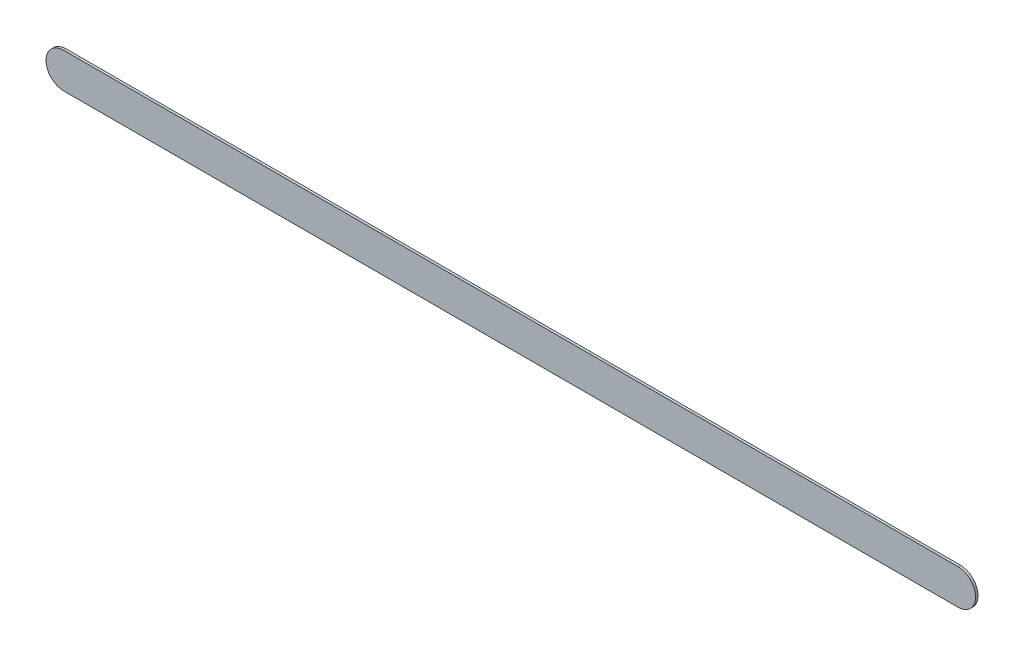
ISO-10303-21;
HEADER;
FILE_DESCRIPTION(('STEP AP214'),'2;1');
FILE_NAME('part.step','',(''),(''),'','','');
FILE_SCHEMA(('AUTOMOTIVE_DESIGN { 1 0 10303 214 1 1 1 1 }'));
ENDSEC;
DATA;
#1=APPLICATION_CONTEXT('core data for automotive mechanical design processes');
#2=APPLICATION_PROTOCOL_DEFINITION('international standard','automotive_design',2000,#1);
#3=PRODUCT_CONTEXT('',#1,'mechanical');
#4=PRODUCT('Part','Part','',(#3));
#5=PRODUCT_RELATED_PRODUCT_CATEGORY('part','',(#4));
#6=PRODUCT_DEFINITION_FORMATION('','',#4);
#7=PRODUCT_DEFINITION_CONTEXT('part definition',#1,'design');
#8=PRODUCT_DEFINITION('design','',#6,#7);
#9=PRODUCT_DEFINITION_SHAPE('','',#8);
#10=(LENGTH_UNIT() NAMED_UNIT(*) SI_UNIT(.MILLI.,.METRE.));
#11=(NAMED_UNIT(*) PLANE_ANGLE_UNIT() SI_UNIT($,.RADIAN.));
#12=(NAMED_UNIT(*) SI_UNIT($,.STERADIAN.) SOLID_ANGLE_UNIT());
#13=UNCERTAINTY_MEASURE_WITH_UNIT(LENGTH_MEASURE(1.E-05),#10,'distance_accuracy_value','');
#14=(GEOMETRIC_REPRESENTATION_CONTEXT(3) GLOBAL_UNCERTAINTY_ASSIGNED_CONTEXT((#13)) GLOBAL_UNIT_ASSIGNED_CONTEXT((#10,
#11,#12)) REPRESENTATION_CONTEXT('',''));
#15=CARTESIAN_POINT('',(0.,0.,0.));
#16=DIRECTION('',(0.,0.,1.));
#17=DIRECTION('',(1.,0.,0.));
#18=AXIS2_PLACEMENT_3D('',#15,#16,#17);
#19=CARTESIAN_POINT('',(174.244,-86.618,0.));
#20=DIRECTION('',(0.,0.,1.));
#21=DIRECTION('',(1.,0.,0.));
#22=AXIS2_PLACEMENT_3D('',#19,#20,#21);
#23=PLANE('',#22);
#24=DIRECTION('',(-1.,0.,0.));
#25=VECTOR('',#24,1.);
#26=CARTESIAN_POINT('',(174.244,-86.618,0.));
#27=LINE('',#26,#25);
#28=CARTESIAN_POINT('',(174.244,-86.618,0.));
#29=VERTEX_POINT('',#28);
#30=CARTESIAN_POINT('',(161.544,-86.618,0.));
#31=VERTEX_POINT('',#30);
#32=EDGE_CURVE('E98',#29,#31,#27,.T.);
#33=ORIENTED_EDGE('',*,*,#32,.T.);
#34=CARTESIAN_POINT('',(161.544,-86.868,0.));
#35=DIRECTION('',(0.,0.,1.));
#36=DIRECTION('',(0.,1.,0.));
#37=AXIS2_PLACEMENT_3D('',#34,#35,#36);
#38=CIRCLE('',#37,0.25);
#39=CARTESIAN_POINT('',(161.544,-87.118,0.));
#40=VERTEX_POINT('',#39);
#41=EDGE_CURVE('E77',#31,#40,#38,.T.);
#42=ORIENTED_EDGE('',*,*,#41,.T.);
#43=DIRECTION('',(1.,0.,0.));
#44=VECTOR('',#43,1.);
#45=CARTESIAN_POINT('',(161.544,-87.118,0.));
#46=LINE('',#45,#44);
#47=CARTESIAN_POINT('',(174.244,-87.118,0.));
#48=VERTEX_POINT('',#47);
#49=EDGE_CURVE('E82',#40,#48,#46,.T.);
#50=ORIENTED_EDGE('',*,*,#49,.T.);
#51=CARTESIAN_POINT('',(174.244,-86.868,0.));
#52=DIRECTION('',(0.,0.,1.));
#53=DIRECTION('',(0.,-1.,0.));
#54=AXIS2_PLACEMENT_3D('',#51,#52,#53);
#55=CIRCLE('',#54,0.25);
#56=EDGE_CURVE('E11',#48,#29,#55,.T.);
#57=ORIENTED_EDGE('',*,*,#56,.T.);
#58=EDGE_LOOP('',(#33,#42,#50,#57));
#59=FACE_BOUND('',#58,.T.);
#60=ADVANCED_FACE('F17',(#59),#23,.T.);
#61=CARTESIAN_POINT('',(174.244,-86.618,-0.035));
#62=DIRECTION('',(0.,0.,1.));
#63=DIRECTION('',(1.,0.,0.));
#64=AXIS2_PLACEMENT_3D('',#61,#62,#63);
#65=PLANE('',#64);
#66=CARTESIAN_POINT('',(174.244,-86.868,-0.035));
#67=DIRECTION('',(0.,0.,1.));
#68=DIRECTION('',(0.,-1.,0.));
#69=AXIS2_PLACEMENT_3D('',#66,#67,#68);
#70=CIRCLE('',#69,0.25);
#71=CARTESIAN_POINT('',(174.244,-87.118,-0.035));
#72=VERTEX_POINT('',#71);
#73=CARTESIAN_POINT('',(174.244,-86.618,-0.035));
#74=VERTEX_POINT('',#73);
#75=EDGE_CURVE('E25',#72,#74,#70,.T.);
#76=ORIENTED_EDGE('',*,*,#75,.F.);
#77=DIRECTION('',(1.,0.,0.));
#78=VECTOR('',#77,1.);
#79=CARTESIAN_POINT('',(161.544,-87.118,-0.035));
#80=LINE('',#79,#78);
#81=CARTESIAN_POINT('',(161.544,-87.118,-0.035));
#82=VERTEX_POINT('',#81);
#83=EDGE_CURVE('E67',#82,#72,#80,.T.);
#84=ORIENTED_EDGE('',*,*,#83,.F.);
#85=CARTESIAN_POINT('',(161.544,-86.868,-0.035));
#86=DIRECTION('',(0.,0.,1.));
#87=DIRECTION('',(0.,1.,0.));
#88=AXIS2_PLACEMENT_3D('',#85,#86,#87);
#89=CIRCLE('',#88,0.25);
#90=CARTESIAN_POINT('',(161.544,-86.618,-0.035));
#91=VERTEX_POINT('',#90);
#92=EDGE_CURVE('E71',#91,#82,#89,.T.);
#93=ORIENTED_EDGE('',*,*,#92,.F.);
#94=DIRECTION('',(-1.,0.,0.));
#95=VECTOR('',#94,1.);
#96=CARTESIAN_POINT('',(174.244,-86.618,-0.035));
#97=LINE('',#96,#95);
#98=EDGE_CURVE('E114',#74,#91,#97,.T.);
#99=ORIENTED_EDGE('',*,*,#98,.F.);
#100=EDGE_LOOP('',(#76,#84,#93,#99));
#101=FACE_BOUND('',#100,.T.);
#102=ADVANCED_FACE('F69',(#101),#65,.F.);
#103=CARTESIAN_POINT('',(174.244,-86.868,-0.035));
#104=DIRECTION('',(0.,0.,-1.));
#105=DIRECTION('',(0.,-1.,0.));
#106=AXIS2_PLACEMENT_3D('',#103,#104,#105);
#107=CYLINDRICAL_SURFACE('',#106,0.25);
#108=ORIENTED_EDGE('',*,*,#75,.T.);
#109=DIRECTION('',(0.,0.,1.));
#110=VECTOR('',#109,1.);
#111=CARTESIAN_POINT('',(174.244,-86.618,-0.035));
#112=LINE('',#111,#110);
#113=EDGE_CURVE('E92',#74,#29,#112,.T.);
#114=ORIENTED_EDGE('',*,*,#113,.T.);
#115=ORIENTED_EDGE('',*,*,#56,.F.);
#116=DIRECTION('',(0.,0.,1.));
#117=VECTOR('',#116,1.);
#118=CARTESIAN_POINT('',(174.244,-87.118,-0.035));
#119=LINE('',#118,#117);
#120=EDGE_CURVE('E76',#72,#48,#119,.T.);
#121=ORIENTED_EDGE('',*,*,#120,.F.);
#122=EDGE_LOOP('',(#108,#114,#115,#121));
#123=FACE_BOUND('',#122,.T.);
#124=ADVANCED_FACE('F110',(#123),#107,.T.);
#125=CARTESIAN_POINT('',(161.544,-87.118,-0.035));
#126=DIRECTION('',(0.,1.,0.));
#127=DIRECTION('',(1.,0.,0.));
#128=AXIS2_PLACEMENT_3D('',#125,#126,#127);
#129=PLANE('',#128);
#130=ORIENTED_EDGE('',*,*,#83,.T.);
#131=ORIENTED_EDGE('',*,*,#120,.T.);
#132=ORIENTED_EDGE('',*,*,#49,.F.);
#133=DIRECTION('',(0.,0.,1.));
#134=VECTOR('',#133,1.);
#135=CARTESIAN_POINT('',(161.544,-87.118,-0.035));
#136=LINE('',#135,#134);
#137=EDGE_CURVE('E80',#82,#40,#136,.T.);
#138=ORIENTED_EDGE('',*,*,#137,.F.);
#139=EDGE_LOOP('',(#130,#131,#132,#138));
#140=FACE_BOUND('',#139,.T.);
#141=ADVANCED_FACE('F81',(#140),#129,.F.);
#142=CARTESIAN_POINT('',(161.544,-86.868,-0.035));
#143=DIRECTION('',(0.,0.,-1.));
#144=DIRECTION('',(0.,1.,0.));
#145=AXIS2_PLACEMENT_3D('',#142,#143,#144);
#146=CYLINDRICAL_SURFACE('',#145,0.25);
#147=ORIENTED_EDGE('',*,*,#92,.T.);
#148=ORIENTED_EDGE('',*,*,#137,.T.);
#149=ORIENTED_EDGE('',*,*,#41,.F.);
#150=DIRECTION('',(0.,0.,1.));
#151=VECTOR('',#150,1.);
#152=CARTESIAN_POINT('',(161.544,-86.618,-0.035));
#153=LINE('',#152,#151);
#154=EDGE_CURVE('E89',#91,#31,#153,.T.);
#155=ORIENTED_EDGE('',*,*,#154,.F.);
#156=EDGE_LOOP('',(#147,#148,#149,#155));
#157=FACE_BOUND('',#156,.T.);
#158=ADVANCED_FACE('F87',(#157),#146,.T.);
#159=CARTESIAN_POINT('',(174.244,-86.618,-0.035));
#160=DIRECTION('',(0.,-1.,0.));
#161=DIRECTION('',(0.,0.,-1.));
#162=AXIS2_PLACEMENT_3D('',#159,#160,#161);
#163=PLANE('',#162);
#164=ORIENTED_EDGE('',*,*,#98,.T.);
#165=ORIENTED_EDGE('',*,*,#154,.T.);
#166=ORIENTED_EDGE('',*,*,#32,.F.);
#167=ORIENTED_EDGE('',*,*,#113,.F.);
#168=EDGE_LOOP('',(#164,#165,#166,#167));
#169=FACE_BOUND('',#168,.T.);
#170=ADVANCED_FACE('F113',(#169),#163,.F.);
#171=CLOSED_SHELL('',(#60,#102,#124,#141,#158,#170));
#172=MANIFOLD_SOLID_BREP('B1',#171);
#173=ADVANCED_BREP_SHAPE_REPRESENTATION('',(#18,#172),#14);
#174=SHAPE_DEFINITION_REPRESENTATION(#9,#173);
ENDSEC;
END-ISO-10303-21;
